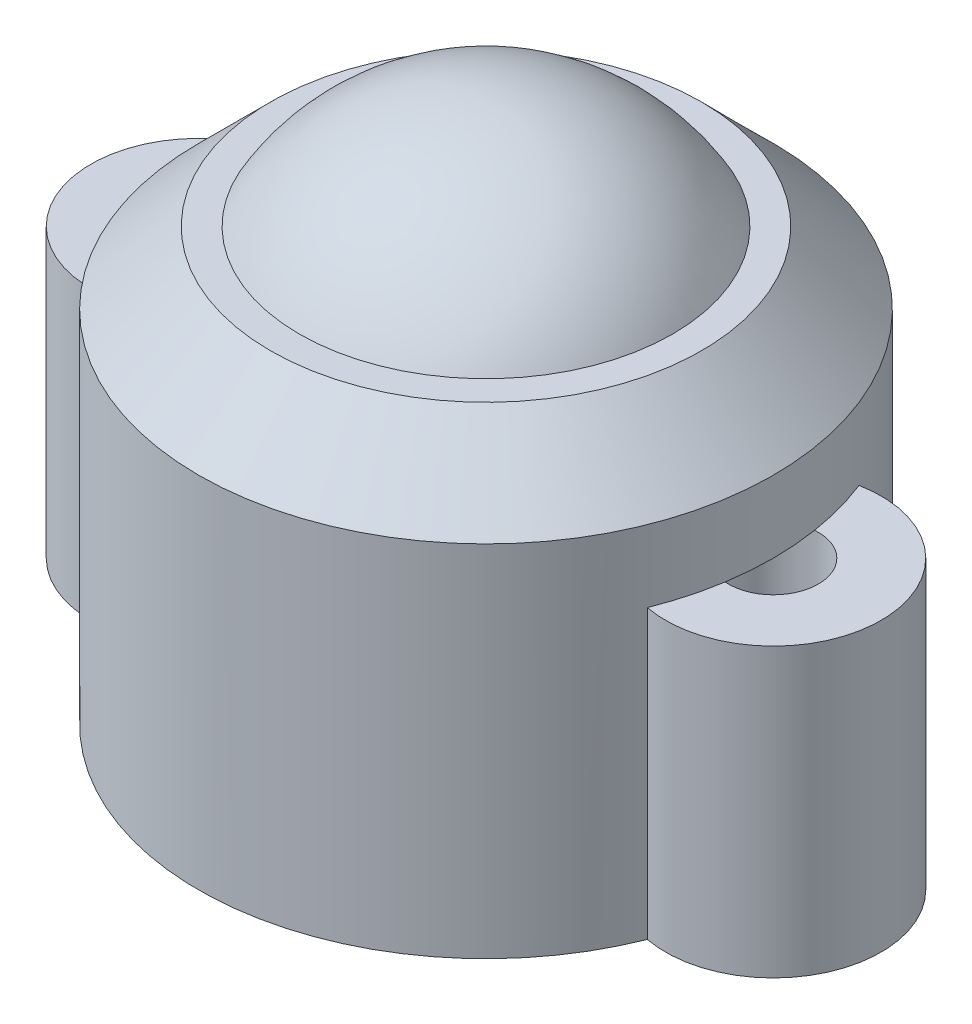
ISO-10303-21;
HEADER;
FILE_DESCRIPTION(('STEP AP214'),'2;1');
FILE_NAME('part.step','',(''),(''),'','','');
FILE_SCHEMA(('AUTOMOTIVE_DESIGN { 1 0 10303 214 1 1 1 1 }'));
ENDSEC;
DATA;
#1=APPLICATION_CONTEXT('core data for automotive mechanical design processes');
#2=APPLICATION_PROTOCOL_DEFINITION('international standard','automotive_design',2000,#1);
#3=PRODUCT_CONTEXT('',#1,'mechanical');
#4=PRODUCT('Part','Part','',(#3));
#5=PRODUCT_RELATED_PRODUCT_CATEGORY('part','',(#4));
#6=PRODUCT_DEFINITION_FORMATION('','',#4);
#7=PRODUCT_DEFINITION_CONTEXT('part definition',#1,'design');
#8=PRODUCT_DEFINITION('design','',#6,#7);
#9=PRODUCT_DEFINITION_SHAPE('','',#8);
#10=(LENGTH_UNIT() NAMED_UNIT(*) SI_UNIT(.MILLI.,.METRE.));
#11=(NAMED_UNIT(*) PLANE_ANGLE_UNIT() SI_UNIT($,.RADIAN.));
#12=(NAMED_UNIT(*) SI_UNIT($,.STERADIAN.) SOLID_ANGLE_UNIT());
#13=UNCERTAINTY_MEASURE_WITH_UNIT(LENGTH_MEASURE(1.E-05),#10,'distance_accuracy_value','');
#14=(GEOMETRIC_REPRESENTATION_CONTEXT(3) GLOBAL_UNCERTAINTY_ASSIGNED_CONTEXT((#13)) GLOBAL_UNIT_ASSIGNED_CONTEXT((#10,
#11,#12)) REPRESENTATION_CONTEXT('',''));
#15=CARTESIAN_POINT('',(0.,0.,0.));
#16=DIRECTION('',(0.,0.,1.));
#17=DIRECTION('',(1.,0.,0.));
#18=AXIS2_PLACEMENT_3D('',#15,#16,#17);
#19=CARTESIAN_POINT('',(-4.,8.,0.));
#20=DIRECTION('',(0.,1.,0.));
#21=DIRECTION('',(0.,0.,1.));
#22=AXIS2_PLACEMENT_3D('',#19,#20,#21);
#23=PLANE('',#22);
#24=CARTESIAN_POINT('',(0.,8.,0.));
#25=DIRECTION('',(0.,1.,0.));
#26=DIRECTION('',(0.,0.,1.));
#27=AXIS2_PLACEMENT_3D('',#24,#25,#26);
#28=CIRCLE('',#27,8.);
#29=CARTESIAN_POINT('',(7.4375,8.,2.94679380853157));
#30=VERTEX_POINT('',#29);
#31=CARTESIAN_POINT('',(7.90234375,8.,1.24617946413666));
#32=VERTEX_POINT('',#31);
#33=EDGE_CURVE('E109',#30,#32,#28,.T.);
#34=ORIENTED_EDGE('',*,*,#33,.F.);
#35=CARTESIAN_POINT('',(8.,8.,0.));
#36=DIRECTION('',(0.,1.,0.));
#37=DIRECTION('',(0.,0.,1.));
#38=AXIS2_PLACEMENT_3D('',#35,#36,#37);
#39=CIRCLE('',#38,3.);
#40=CARTESIAN_POINT('',(7.4375,8.,-2.94679380853157));
#41=VERTEX_POINT('',#40);
#42=EDGE_CURVE('E92',#30,#41,#39,.T.);
#43=ORIENTED_EDGE('',*,*,#42,.T.);
#44=CARTESIAN_POINT('',(7.90234375,8.,-1.24617946413666));
#45=VERTEX_POINT('',#44);
#46=EDGE_CURVE('E128',#45,#41,#28,.T.);
#47=ORIENTED_EDGE('',*,*,#46,.F.);
#48=CARTESIAN_POINT('',(8.,8.,0.));
#49=DIRECTION('',(0.,1.,0.));
#50=DIRECTION('',(0.,0.,1.));
#51=AXIS2_PLACEMENT_3D('',#48,#49,#50);
#52=CIRCLE('',#51,1.25);
#53=EDGE_CURVE('E117',#32,#45,#52,.T.);
#54=ORIENTED_EDGE('',*,*,#53,.F.);
#55=EDGE_LOOP('',(#34,#43,#47,#54));
#56=FACE_BOUND('',#55,.T.);
#57=ADVANCED_FACE('F39',(#56),#23,.T.);
#58=CARTESIAN_POINT('',(-7.4375,8.,-2.94679380853157));
#59=VERTEX_POINT('',#58);
#60=CARTESIAN_POINT('',(-7.90234375,8.,-1.24617946413666));
#61=VERTEX_POINT('',#60);
#62=EDGE_CURVE('E133',#59,#61,#28,.T.);
#63=ORIENTED_EDGE('',*,*,#62,.F.);
#64=CARTESIAN_POINT('',(-8.,8.,0.));
#65=DIRECTION('',(0.,1.,0.));
#66=DIRECTION('',(0.,0.,-1.));
#67=AXIS2_PLACEMENT_3D('',#64,#65,#66);
#68=CIRCLE('',#67,3.);
#69=CARTESIAN_POINT('',(-7.4375,8.,2.94679380853157));
#70=VERTEX_POINT('',#69);
#71=EDGE_CURVE('E103',#59,#70,#68,.T.);
#72=ORIENTED_EDGE('',*,*,#71,.T.);
#73=CARTESIAN_POINT('',(-7.90234375,8.,1.24617946413666));
#74=VERTEX_POINT('',#73);
#75=EDGE_CURVE('E61',#74,#70,#28,.T.);
#76=ORIENTED_EDGE('',*,*,#75,.F.);
#77=CARTESIAN_POINT('',(-8.,8.,0.));
#78=DIRECTION('',(0.,1.,0.));
#79=DIRECTION('',(0.,0.,-1.));
#80=AXIS2_PLACEMENT_3D('',#77,#78,#79);
#81=CIRCLE('',#80,1.25);
#82=EDGE_CURVE('E56',#61,#74,#81,.T.);
#83=ORIENTED_EDGE('',*,*,#82,.F.);
#84=EDGE_LOOP('',(#63,#72,#76,#83));
#85=FACE_BOUND('',#84,.T.);
#86=ADVANCED_FACE('F188',(#85),#23,.T.);
#87=CARTESIAN_POINT('',(-4.,0.,0.));
#88=DIRECTION('',(0.,1.,0.));
#89=DIRECTION('',(0.,0.,1.));
#90=AXIS2_PLACEMENT_3D('',#87,#88,#89);
#91=PLANE('',#90);
#92=CARTESIAN_POINT('',(0.,0.,0.));
#93=DIRECTION('',(0.,1.,0.));
#94=DIRECTION('',(0.,0.,1.));
#95=AXIS2_PLACEMENT_3D('',#92,#93,#94);
#96=CIRCLE('',#95,8.);
#97=CARTESIAN_POINT('',(7.4375,0.,-2.94679380853157));
#98=VERTEX_POINT('',#97);
#99=CARTESIAN_POINT('',(-7.4375,0.,-2.94679380853157));
#100=VERTEX_POINT('',#99);
#101=EDGE_CURVE('E165',#98,#100,#96,.T.);
#102=ORIENTED_EDGE('',*,*,#101,.F.);
#103=CARTESIAN_POINT('',(8.,0.,0.));
#104=DIRECTION('',(0.,1.,0.));
#105=DIRECTION('',(0.,0.,1.));
#106=AXIS2_PLACEMENT_3D('',#103,#104,#105);
#107=CIRCLE('',#106,3.);
#108=CARTESIAN_POINT('',(7.4375,0.,2.94679380853157));
#109=VERTEX_POINT('',#108);
#110=EDGE_CURVE('E175',#109,#98,#107,.T.);
#111=ORIENTED_EDGE('',*,*,#110,.F.);
#112=CARTESIAN_POINT('',(0.,0.,0.));
#113=DIRECTION('',(0.,1.,0.));
#114=DIRECTION('',(0.,0.,1.));
#115=AXIS2_PLACEMENT_3D('',#112,#113,#114);
#116=CIRCLE('',#115,8.);
#117=CARTESIAN_POINT('',(-7.4375,0.,2.94679380853157));
#118=VERTEX_POINT('',#117);
#119=EDGE_CURVE('E112',#118,#109,#116,.T.);
#120=ORIENTED_EDGE('',*,*,#119,.F.);
#121=CARTESIAN_POINT('',(-8.,0.,0.));
#122=DIRECTION('',(0.,1.,0.));
#123=DIRECTION('',(0.,0.,-1.));
#124=AXIS2_PLACEMENT_3D('',#121,#122,#123);
#125=CIRCLE('',#124,3.);
#126=EDGE_CURVE('E167',#100,#118,#125,.T.);
#127=ORIENTED_EDGE('',*,*,#126,.F.);
#128=EDGE_LOOP('',(#102,#111,#120,#127));
#129=FACE_BOUND('',#128,.T.);
#130=CARTESIAN_POINT('',(8.,0.,0.));
#131=DIRECTION('',(0.,1.,0.));
#132=DIRECTION('',(0.,0.,1.));
#133=AXIS2_PLACEMENT_3D('',#130,#131,#132);
#134=CIRCLE('',#133,1.25);
#135=CARTESIAN_POINT('',(8.,0.,1.25));
#136=VERTEX_POINT('',#135);
#137=EDGE_CURVE('E160',#136,#136,#134,.T.);
#138=ORIENTED_EDGE('',*,*,#137,.T.);
#139=EDGE_LOOP('',(#138));
#140=FACE_BOUND('',#139,.T.);
#141=CARTESIAN_POINT('',(-8.,0.,0.));
#142=DIRECTION('',(0.,1.,0.));
#143=DIRECTION('',(0.,0.,-1.));
#144=AXIS2_PLACEMENT_3D('',#141,#142,#143);
#145=CIRCLE('',#144,1.25);
#146=CARTESIAN_POINT('',(-8.,0.,-1.25));
#147=VERTEX_POINT('',#146);
#148=EDGE_CURVE('E120',#147,#147,#145,.T.);
#149=ORIENTED_EDGE('',*,*,#148,.T.);
#150=EDGE_LOOP('',(#149));
#151=FACE_BOUND('',#150,.T.);
#152=ADVANCED_FACE('F185',(#129,#140,#151),#91,.F.);
#153=CARTESIAN_POINT('',(-8.,8.,0.));
#154=DIRECTION('',(0.,-1.,0.));
#155=DIRECTION('',(0.,0.,-1.));
#156=AXIS2_PLACEMENT_3D('',#153,#154,#155);
#157=CYLINDRICAL_SURFACE('',#156,3.);
#158=ORIENTED_EDGE('',*,*,#126,.T.);
#159=DIRECTION('',(0.,-1.,0.));
#160=VECTOR('',#159,1.);
#161=CARTESIAN_POINT('',(-7.4375,8.,2.94679380853157));
#162=LINE('',#161,#160);
#163=EDGE_CURVE('E114',#70,#118,#162,.T.);
#164=ORIENTED_EDGE('',*,*,#163,.F.);
#165=ORIENTED_EDGE('',*,*,#71,.F.);
#166=DIRECTION('',(0.,-1.,0.));
#167=VECTOR('',#166,1.);
#168=CARTESIAN_POINT('',(-7.4375,8.,-2.94679380853157));
#169=LINE('',#168,#167);
#170=EDGE_CURVE('E134',#59,#100,#169,.T.);
#171=ORIENTED_EDGE('',*,*,#170,.T.);
#172=EDGE_LOOP('',(#158,#164,#165,#171));
#173=FACE_BOUND('',#172,.T.);
#174=ADVANCED_FACE('F190',(#173),#157,.T.);
#175=CARTESIAN_POINT('',(0.,8.,0.));
#176=DIRECTION('',(0.,-1.,0.));
#177=DIRECTION('',(0.,0.,-1.));
#178=AXIS2_PLACEMENT_3D('',#175,#176,#177);
#179=CYLINDRICAL_SURFACE('',#178,8.);
#180=CARTESIAN_POINT('',(0.,9.99999999999999,0.));
#181=DIRECTION('',(0.,1.,0.));
#182=DIRECTION('',(0.,0.,1.));
#183=AXIS2_PLACEMENT_3D('',#180,#181,#182);
#184=CIRCLE('',#183,8.);
#185=CARTESIAN_POINT('',(0.,9.99999999999999,8.));
#186=VERTEX_POINT('',#185);
#187=EDGE_CURVE('E11',#186,#186,#184,.F.);
#188=ORIENTED_EDGE('',*,*,#187,.T.);
#189=EDGE_LOOP('',(#188));
#190=FACE_BOUND('',#189,.T.);
#191=ORIENTED_EDGE('',*,*,#119,.T.);
#192=DIRECTION('',(0.,-1.,0.));
#193=VECTOR('',#192,1.);
#194=CARTESIAN_POINT('',(7.4375,8.,2.94679380853157));
#195=LINE('',#194,#193);
#196=EDGE_CURVE('E95',#30,#109,#195,.T.);
#197=ORIENTED_EDGE('',*,*,#196,.F.);
#198=ORIENTED_EDGE('',*,*,#33,.T.);
#199=EDGE_CURVE('E121',#32,#45,#28,.T.);
#200=ORIENTED_EDGE('',*,*,#199,.T.);
#201=ORIENTED_EDGE('',*,*,#46,.T.);
#202=DIRECTION('',(0.,-1.,0.));
#203=VECTOR('',#202,1.);
#204=CARTESIAN_POINT('',(7.4375,8.,-2.94679380853157));
#205=LINE('',#204,#203);
#206=EDGE_CURVE('E98',#41,#98,#205,.T.);
#207=ORIENTED_EDGE('',*,*,#206,.T.);
#208=ORIENTED_EDGE('',*,*,#101,.T.);
#209=ORIENTED_EDGE('',*,*,#170,.F.);
#210=ORIENTED_EDGE('',*,*,#62,.T.);
#211=EDGE_CURVE('E123',#61,#74,#28,.T.);
#212=ORIENTED_EDGE('',*,*,#211,.T.);
#213=ORIENTED_EDGE('',*,*,#75,.T.);
#214=ORIENTED_EDGE('',*,*,#163,.T.);
#215=EDGE_LOOP('',(#191,#197,#198,#200,#201,#207,#208,#209,#210,#212,#213,#214));
#216=FACE_BOUND('',#215,.T.);
#217=ADVANCED_FACE('F107',(#190,#216),#179,.T.);
#218=CARTESIAN_POINT('',(8.,8.,0.));
#219=DIRECTION('',(0.,-1.,0.));
#220=DIRECTION('',(0.,0.,-1.));
#221=AXIS2_PLACEMENT_3D('',#218,#219,#220);
#222=CYLINDRICAL_SURFACE('',#221,3.);
#223=ORIENTED_EDGE('',*,*,#110,.T.);
#224=ORIENTED_EDGE('',*,*,#206,.F.);
#225=ORIENTED_EDGE('',*,*,#42,.F.);
#226=ORIENTED_EDGE('',*,*,#196,.T.);
#227=EDGE_LOOP('',(#223,#224,#225,#226));
#228=FACE_BOUND('',#227,.T.);
#229=ADVANCED_FACE('F94',(#228),#222,.T.);
#230=CARTESIAN_POINT('',(8.,8.,0.));
#231=DIRECTION('',(0.,-1.,0.));
#232=DIRECTION('',(0.,0.,-1.));
#233=AXIS2_PLACEMENT_3D('',#230,#231,#232);
#234=CYLINDRICAL_SURFACE('',#233,1.25);
#235=EDGE_CURVE('E158',#45,#32,#52,.T.);
#236=ORIENTED_EDGE('',*,*,#235,.T.);
#237=ORIENTED_EDGE('',*,*,#53,.T.);
#238=EDGE_LOOP('',(#236,#237));
#239=FACE_BOUND('',#238,.T.);
#240=ORIENTED_EDGE('',*,*,#137,.F.);
#241=EDGE_LOOP('',(#240));
#242=FACE_BOUND('',#241,.T.);
#243=ADVANCED_FACE('F156',(#239,#242),#234,.F.);
#244=CARTESIAN_POINT('',(-8.,8.,0.));
#245=DIRECTION('',(0.,-1.,0.));
#246=DIRECTION('',(0.,0.,-1.));
#247=AXIS2_PLACEMENT_3D('',#244,#245,#246);
#248=CYLINDRICAL_SURFACE('',#247,1.25);
#249=EDGE_CURVE('E173',#74,#61,#81,.T.);
#250=ORIENTED_EDGE('',*,*,#249,.T.);
#251=ORIENTED_EDGE('',*,*,#82,.T.);
#252=EDGE_LOOP('',(#250,#251));
#253=FACE_BOUND('',#252,.T.);
#254=ORIENTED_EDGE('',*,*,#148,.F.);
#255=EDGE_LOOP('',(#254));
#256=FACE_BOUND('',#255,.T.);
#257=ADVANCED_FACE('F211',(#253,#256),#248,.F.);
#258=CARTESIAN_POINT('',(0.,8.,0.));
#259=DIRECTION('',(0.,1.,0.));
#260=DIRECTION('',(0.,0.,1.));
#261=AXIS2_PLACEMENT_3D('',#258,#259,#260);
#262=PLANE('',#261);
#263=ORIENTED_EDGE('',*,*,#235,.F.);
#264=ORIENTED_EDGE('',*,*,#199,.F.);
#265=EDGE_LOOP('',(#263,#264));
#266=FACE_BOUND('',#265,.T.);
#267=ADVANCED_FACE('F163',(#266),#262,.F.);
#268=CARTESIAN_POINT('',(0.,12.,0.));
#269=DIRECTION('',(0.,1.,0.));
#270=DIRECTION('',(0.,0.,1.));
#271=AXIS2_PLACEMENT_3D('',#268,#269,#270);
#272=PLANE('',#271);
#273=CARTESIAN_POINT('',(0.,12.,0.));
#274=DIRECTION('',(0.,1.,0.));
#275=DIRECTION('',(0.,0.,1.));
#276=AXIS2_PLACEMENT_3D('',#273,#274,#275);
#277=CIRCLE('',#276,5.19615242270663);
#278=CARTESIAN_POINT('',(0.,12.,5.19615242270663));
#279=VERTEX_POINT('',#278);
#280=EDGE_CURVE('E43',#279,#279,#277,.F.);
#281=ORIENTED_EDGE('',*,*,#280,.T.);
#282=EDGE_LOOP('',(#281));
#283=FACE_BOUND('',#282,.T.);
#284=CARTESIAN_POINT('',(0.,12.,0.));
#285=DIRECTION('',(0.,1.,0.));
#286=DIRECTION('',(0.,0.,1.));
#287=AXIS2_PLACEMENT_3D('',#284,#285,#286);
#288=CIRCLE('',#287,6.00000000000001);
#289=CARTESIAN_POINT('',(0.,12.,6.00000000000001));
#290=VERTEX_POINT('',#289);
#291=EDGE_CURVE('E49',#290,#290,#288,.T.);
#292=ORIENTED_EDGE('',*,*,#291,.T.);
#293=EDGE_LOOP('',(#292));
#294=FACE_BOUND('',#293,.T.);
#295=ADVANCED_FACE('F219',(#283,#294),#272,.T.);
#296=ORIENTED_EDGE('',*,*,#249,.F.);
#297=ORIENTED_EDGE('',*,*,#211,.F.);
#298=EDGE_LOOP('',(#296,#297));
#299=FACE_BOUND('',#298,.T.);
#300=ADVANCED_FACE('F221',(#299),#262,.F.);
#301=CARTESIAN_POINT('',(0.,12.,0.));
#302=DIRECTION('',(0.,-1.,0.));
#303=DIRECTION('',(0.,0.,-1.));
#304=AXIS2_PLACEMENT_3D('',#301,#302,#303);
#305=CONICAL_SURFACE('',#304,6.00000000000001,0.785398163397445);
#306=ORIENTED_EDGE('',*,*,#187,.F.);
#307=EDGE_LOOP('',(#306));
#308=FACE_BOUND('',#307,.T.);
#309=ORIENTED_EDGE('',*,*,#291,.F.);
#310=EDGE_LOOP('',(#309));
#311=FACE_BOUND('',#310,.T.);
#312=ADVANCED_FACE('F41',(#308,#311),#305,.T.);
#313=CARTESIAN_POINT('',(0.,9.,0.));
#314=DIRECTION('',(0.,1.,0.));
#315=DIRECTION('',(1.,0.,0.));
#316=AXIS2_PLACEMENT_3D('',#313,#314,#315);
#317=SPHERICAL_SURFACE('',#316,6.);
#318=ORIENTED_EDGE('',*,*,#280,.F.);
#319=EDGE_LOOP('',(#318));
#320=FACE_BOUND('',#319,.T.);
#321=ADVANCED_FACE('F229',(#320),#317,.T.);
#322=CLOSED_SHELL('',(#57,#86,#152,#174,#217,#229,#243,#257,#267,#295,#300,#312,#321));
#323=MANIFOLD_SOLID_BREP('B2',#322);
#324=ADVANCED_BREP_SHAPE_REPRESENTATION('',(#18,#323),#14);
#325=SHAPE_DEFINITION_REPRESENTATION(#9,#324);
ENDSEC;
END-ISO-10303-21;
